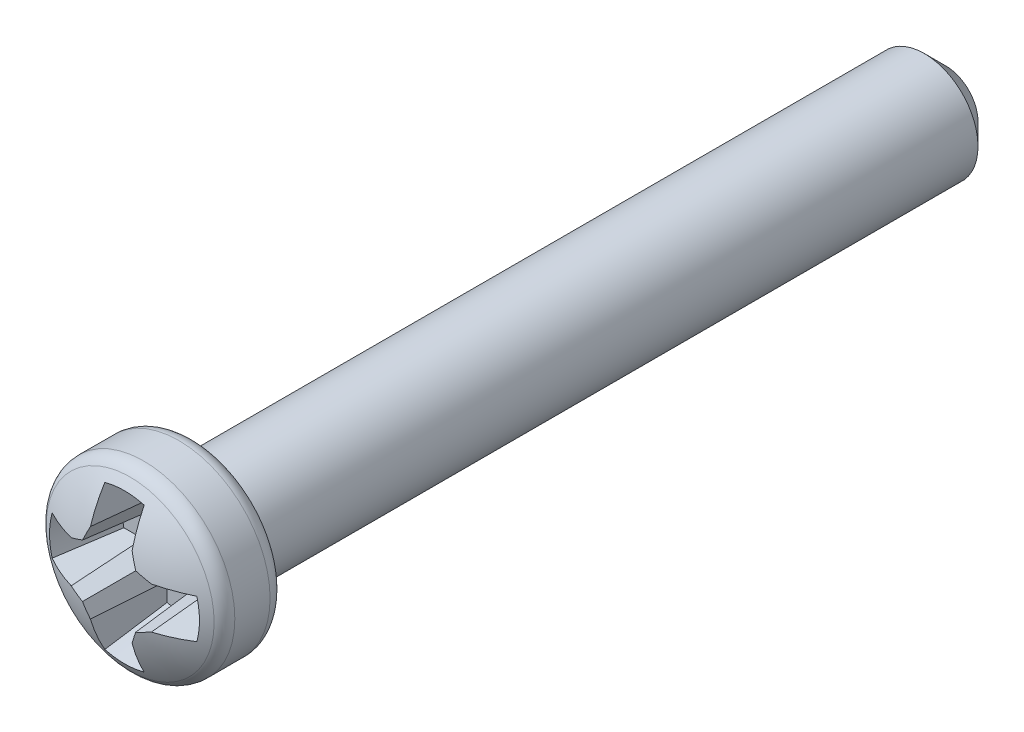
ISO-10303-21;
HEADER;
FILE_DESCRIPTION(('STEP AP214'),'2;1');
FILE_NAME('part.step','',(''),(''),'','','');
FILE_SCHEMA(('AUTOMOTIVE_DESIGN { 1 0 10303 214 1 1 1 1 }'));
ENDSEC;
DATA;
#1=APPLICATION_CONTEXT('core data for automotive mechanical design processes');
#2=APPLICATION_PROTOCOL_DEFINITION('international standard','automotive_design',2000,#1);
#3=PRODUCT_CONTEXT('',#1,'mechanical');
#4=PRODUCT('Part','Part','',(#3));
#5=PRODUCT_RELATED_PRODUCT_CATEGORY('part','',(#4));
#6=PRODUCT_DEFINITION_FORMATION('','',#4);
#7=PRODUCT_DEFINITION_CONTEXT('part definition',#1,'design');
#8=PRODUCT_DEFINITION('design','',#6,#7);
#9=PRODUCT_DEFINITION_SHAPE('','',#8);
#10=(LENGTH_UNIT() NAMED_UNIT(*) SI_UNIT(.MILLI.,.METRE.));
#11=(NAMED_UNIT(*) PLANE_ANGLE_UNIT() SI_UNIT($,.RADIAN.));
#12=(NAMED_UNIT(*) SI_UNIT($,.STERADIAN.) SOLID_ANGLE_UNIT());
#13=UNCERTAINTY_MEASURE_WITH_UNIT(LENGTH_MEASURE(1.E-05),#10,'distance_accuracy_value','');
#14=(GEOMETRIC_REPRESENTATION_CONTEXT(3) GLOBAL_UNCERTAINTY_ASSIGNED_CONTEXT((#13)) GLOBAL_UNIT_ASSIGNED_CONTEXT((#10,
#11,#12)) REPRESENTATION_CONTEXT('',''));
#15=CARTESIAN_POINT('',(0.,0.,0.));
#16=DIRECTION('',(0.,0.,1.));
#17=DIRECTION('',(1.,0.,0.));
#18=AXIS2_PLACEMENT_3D('',#15,#16,#17);
#19=CARTESIAN_POINT('',(-0.400000000000011,0.,15.7));
#20=DIRECTION('',(0.996194698091745,0.,0.0871557427476592));
#21=DIRECTION('',(0.,-1.,-1.20531199141214E-13));
#22=AXIS2_PLACEMENT_3D('',#19,#20,#21);
#23=PLANE('',#22);
#24=CARTESIAN_POINT('',(-0.155769339122426,0.,12.9084307722313));
#25=DIRECTION('',(0.996194698091745,0.,0.0871557427476592));
#26=DIRECTION('',(0.0871557427476592,0.,-0.996194698091745));
#27=AXIS2_PLACEMENT_3D('',#24,#25,#26);
#28=CIRCLE('',#27,2.77353697814506);
#29=CARTESIAN_POINT('',(-0.366942453606423,1.34976675197879,15.3221505157205));
#30=VERTEX_POINT('',#29);
#31=CARTESIAN_POINT('',(-0.388548913673451,0.747722237309709,15.5691134843641));
#32=VERTEX_POINT('',#31);
#33=EDGE_CURVE('E393',#30,#32,#28,.T.);
#34=ORIENTED_EDGE('',*,*,#33,.T.);
#35=DIRECTION('',(-0.0871426484044404,0.0173337504938601,0.996045029063886));
#36=VECTOR('',#35,1.);
#37=CARTESIAN_POINT('',(-0.400815427513501,0.750162198617128,15.7093203791284));
#38=LINE('',#37,#36);
#39=CARTESIAN_POINT('',(-0.273578881205041,0.724853275973701,14.255));
#40=VERTEX_POINT('',#39);
#41=EDGE_CURVE('E11',#40,#32,#38,.T.);
#42=ORIENTED_EDGE('',*,*,#41,.F.);
#43=DIRECTION('',(0.,-1.,0.));
#44=VECTOR('',#43,1.);
#45=CARTESIAN_POINT('',(-0.273578881205049,0.,14.255));
#46=LINE('',#45,#44);
#47=CARTESIAN_POINT('',(-0.273578881205038,1.07866041768189,14.255));
#48=VERTEX_POINT('',#47);
#49=EDGE_CURVE('E23',#48,#40,#46,.T.);
#50=ORIENTED_EDGE('',*,*,#49,.F.);
#51=CARTESIAN_POINT('',(-0.273578881205038,1.07866041768189,14.255));
#52=CARTESIAN_POINT('',(-0.304698622172029,1.16909490040446,14.6107002669011));
#53=CARTESIAN_POINT('',(-0.335820104838195,1.25945048805327,14.9664204415149));
#54=CARTESIAN_POINT('',(-0.366942453606423,1.34976675197879,15.3221505157205));
#55=(BOUNDED_CURVE() B_SPLINE_CURVE(3,(#51,#52,#53,#54),.UNSPECIFIED.,.F.,
.F.) B_SPLINE_CURVE_WITH_KNOTS((4,4),(0.0101147351762878,0.0112197354916044),
.UNSPECIFIED.) CURVE() GEOMETRIC_REPRESENTATION_ITEM() RATIONAL_B_SPLINE_CURVE((1.,1.,1.,1.)) REPRESENTATION_ITEM(''));
#56=EDGE_CURVE('E236',#48,#30,#55,.T.);
#57=ORIENTED_EDGE('',*,*,#56,.T.);
#58=EDGE_LOOP('',(#34,#42,#50,#57));
#59=FACE_BOUND('',#58,.T.);
#60=ADVANCED_FACE('F19',(#59),#23,.T.);
#61=CARTESIAN_POINT('',(-0.606586399182272,0.251256313292342,15.7));
#62=DIRECTION('',(0.920363891963223,-0.381227206369657,0.0871557427476588));
#63=DIRECTION('',(0.,-0.222868776578235,-0.974848454082234));
#64=AXIS2_PLACEMENT_3D('',#61,#62,#63);
#65=PLANE('',#64);
#66=CARTESIAN_POINT('',(-0.379146146396833,0.157047475959057,12.8861548030787));
#67=DIRECTION('',(0.920363891963223,-0.381227206369658,0.0871557427476588));
#68=DIRECTION('',(0.382683432365094,0.923879532511285,0.));
#69=AXIS2_PLACEMENT_3D('',#66,#67,#68);
#70=CIRCLE('',#69,2.74722630506);
#71=CARTESIAN_POINT('',(-0.496473166513852,0.496473166513839,15.6098062018733));
#72=VERTEX_POINT('',#71);
#73=EDGE_CURVE('E348',#32,#72,#70,.T.);
#74=ORIENTED_EDGE('',*,*,#73,.T.);
#75=DIRECTION('',(-0.0666626913468326,0.0666626913468326,0.995546167269401));
#76=VECTOR('',#75,1.);
#77=CARTESIAN_POINT('',(-0.5018585599701,0.501858559970086,15.6902321148732));
#78=LINE('',#77,#76);
#79=CARTESIAN_POINT('',(-0.405754091256932,0.405754091256919,14.255));
#80=VERTEX_POINT('',#79);
#81=EDGE_CURVE('E30',#80,#72,#78,.T.);
#82=ORIENTED_EDGE('',*,*,#81,.F.);
#83=DIRECTION('',(-0.382683432365094,-0.923879532511285,0.));
#84=VECTOR('',#83,1.);
#85=CARTESIAN_POINT('',(-0.489788515050423,0.202877045628466,14.255));
#86=LINE('',#85,#84);
#87=EDGE_CURVE('E242',#40,#80,#86,.T.);
#88=ORIENTED_EDGE('',*,*,#87,.F.);
#89=ORIENTED_EDGE('',*,*,#41,.T.);
#90=EDGE_LOOP('',(#74,#82,#88,#89));
#91=FACE_BOUND('',#90,.T.);
#92=ADVANCED_FACE('F596',(#91),#65,.T.);
#93=CARTESIAN_POINT('',(-0.251256313292353,0.606586399182252,15.7));
#94=DIRECTION('',(0.381227206369636,-0.920363891963232,0.0871557427476579));
#95=DIRECTION('',(0.,-0.0942752822069807,-0.995546167269401));
#96=AXIS2_PLACEMENT_3D('',#93,#94,#95);
#97=PLANE('',#96);
#98=CARTESIAN_POINT('',(-0.157047475959054,0.379146146396823,12.8861548030787));
#99=DIRECTION('',(0.381227206369636,-0.920363891963232,0.0871557427476579));
#100=DIRECTION('',(0.923879532511294,0.382683432365072,0.));
#101=AXIS2_PLACEMENT_3D('',#98,#99,#100);
#102=CIRCLE('',#101,2.74722630506);
#103=CARTESIAN_POINT('',(-0.747722237309725,0.388548913673444,15.5691134843641));
#104=VERTEX_POINT('',#103);
#105=EDGE_CURVE('E344',#72,#104,#102,.T.);
#106=ORIENTED_EDGE('',*,*,#105,.T.);
#107=DIRECTION('',(-0.0173337504938597,0.087142648404439,0.996045029063886));
#108=VECTOR('',#107,1.);
#109=CARTESIAN_POINT('',(-0.74977465582037,0.398867118306383,15.6870511029892));
#110=LINE('',#109,#108);
#111=CARTESIAN_POINT('',(-0.724853275973718,0.273578881205036,14.255));
#112=VERTEX_POINT('',#111);
#113=EDGE_CURVE('E405',#112,#104,#110,.T.);
#114=ORIENTED_EDGE('',*,*,#113,.F.);
#115=DIRECTION('',(-0.923879532511294,-0.382683432365072,0.));
#116=VECTOR('',#115,1.);
#117=CARTESIAN_POINT('',(-0.20287704562845,0.489788515050416,14.255));
#118=LINE('',#117,#116);
#119=EDGE_CURVE('E458',#80,#112,#118,.T.);
#120=ORIENTED_EDGE('',*,*,#119,.F.);
#121=ORIENTED_EDGE('',*,*,#81,.T.);
#122=EDGE_LOOP('',(#106,#114,#120,#121));
#123=FACE_BOUND('',#122,.T.);
#124=ADVANCED_FACE('F600',(#123),#97,.T.);
#125=CARTESIAN_POINT('',(0.,0.399999999999987,15.7));
#126=DIRECTION('',(0.,-0.996194698091746,0.0871557427476576));
#127=DIRECTION('',(-1.,0.,0.));
#128=AXIS2_PLACEMENT_3D('',#125,#126,#127);
#129=PLANE('',#128);
#130=CARTESIAN_POINT('',(0.,0.155769339122407,12.9084307722313));
#131=DIRECTION('',(0.,-0.996194698091746,0.0871557427476576));
#132=DIRECTION('',(0.,-0.0871557427476576,-0.996194698091746));
#133=AXIS2_PLACEMENT_3D('',#130,#131,#132);
#134=CIRCLE('',#133,2.77353697814506);
#135=CARTESIAN_POINT('',(-1.3497667519788,0.366942453606429,15.3221505157205));
#136=VERTEX_POINT('',#135);
#137=EDGE_CURVE('E349',#104,#136,#134,.T.);
#138=ORIENTED_EDGE('',*,*,#137,.T.);
#139=CARTESIAN_POINT('',(-1.07866041768188,0.273578881205039,14.255));
#140=CARTESIAN_POINT('',(-1.16909490040445,0.304698622172032,14.6107002669011));
#141=CARTESIAN_POINT('',(-1.25945048805327,0.335820104838199,14.9664204415149));
#142=CARTESIAN_POINT('',(-1.3497667519788,0.366942453606429,15.3221505157205));
#143=(BOUNDED_CURVE() B_SPLINE_CURVE(3,(#139,#140,#141,#142),.UNSPECIFIED.,.F.,
.F.) B_SPLINE_CURVE_WITH_KNOTS((4,4),(0.00303333154714993,0.00413833274330227),
.UNSPECIFIED.) CURVE() GEOMETRIC_REPRESENTATION_ITEM() RATIONAL_B_SPLINE_CURVE((1.,1.,1.,1.)) REPRESENTATION_ITEM(''));
#144=CARTESIAN_POINT('',(-1.07866041768188,0.273578881205039,14.255));
#145=VERTEX_POINT('',#144);
#146=EDGE_CURVE('E408',#145,#136,#143,.T.);
#147=ORIENTED_EDGE('',*,*,#146,.F.);
#148=DIRECTION('',(-1.,0.,0.));
#149=VECTOR('',#148,1.);
#150=CARTESIAN_POINT('',(0.,0.273578881205028,14.255));
#151=LINE('',#150,#149);
#152=EDGE_CURVE('E471',#112,#145,#151,.T.);
#153=ORIENTED_EDGE('',*,*,#152,.F.);
#154=ORIENTED_EDGE('',*,*,#113,.T.);
#155=EDGE_LOOP('',(#138,#147,#153,#154));
#156=FACE_BOUND('',#155,.T.);
#157=ADVANCED_FACE('F602',(#156),#129,.T.);
#158=CARTESIAN_POINT('',(0.,0.,15.7));
#159=DIRECTION('',(0.,0.,1.));
#160=DIRECTION('',(-1.,0.,0.));
#161=AXIS2_PLACEMENT_3D('',#158,#159,#160);
#162=CONICAL_SURFACE('',#161,1.5,0.26179938779915);
#163=CARTESIAN_POINT('',(0.,0.,15.3221505157205));
#164=DIRECTION('',(0.,0.,1.));
#165=DIRECTION('',(-1.,0.,0.));
#166=AXIS2_PLACEMENT_3D('',#163,#164,#165);
#167=CIRCLE('',#166,1.39875553582679);
#168=CARTESIAN_POINT('',(-1.3497667519788,-0.36694245360644,15.3221505157205));
#169=VERTEX_POINT('',#168);
#170=EDGE_CURVE('E379',#136,#169,#167,.T.);
#171=ORIENTED_EDGE('',*,*,#170,.T.);
#172=CARTESIAN_POINT('',(-1.07866041768189,-0.273578881205053,14.255));
#173=CARTESIAN_POINT('',(-1.16909490040446,-0.304698622172045,14.6107002669011));
#174=CARTESIAN_POINT('',(-1.25945048805328,-0.335820104838211,14.9664204415149));
#175=CARTESIAN_POINT('',(-1.3497667519788,-0.36694245360644,15.3221505157205));
#176=(BOUNDED_CURVE() B_SPLINE_CURVE(3,(#172,#173,#174,#175),.UNSPECIFIED.,.F.,
.F.) B_SPLINE_CURVE_WITH_KNOTS((4,4),(0.0101147351762878,0.0112197354916044),
.UNSPECIFIED.) CURVE() GEOMETRIC_REPRESENTATION_ITEM() RATIONAL_B_SPLINE_CURVE((1.,1.,1.,1.)) REPRESENTATION_ITEM(''));
#177=CARTESIAN_POINT('',(-1.07866041768189,-0.273578881205053,14.255));
#178=VERTEX_POINT('',#177);
#179=EDGE_CURVE('E368',#178,#169,#176,.T.);
#180=ORIENTED_EDGE('',*,*,#179,.F.);
#181=CARTESIAN_POINT('',(0.,0.,14.255));
#182=DIRECTION('',(0.,0.,1.));
#183=DIRECTION('',(1.,0.,0.));
#184=AXIS2_PLACEMENT_3D('',#181,#182,#183);
#185=CIRCLE('',#184,1.11281341693703);
#186=EDGE_CURVE('E415',#145,#178,#185,.T.);
#187=ORIENTED_EDGE('',*,*,#186,.F.);
#188=ORIENTED_EDGE('',*,*,#146,.T.);
#189=EDGE_LOOP('',(#171,#180,#187,#188));
#190=FACE_BOUND('',#189,.T.);
#191=ADVANCED_FACE('F606',(#190),#162,.F.);
#192=CARTESIAN_POINT('',(0.,-0.400000000000023,15.7));
#193=DIRECTION('',(0.,0.996194698091745,0.08715574274766));
#194=DIRECTION('',(1.,0.,0.));
#195=AXIS2_PLACEMENT_3D('',#192,#193,#194);
#196=PLANE('',#195);
#197=CARTESIAN_POINT('',(0.,-0.155769339122436,12.9084307722313));
#198=DIRECTION('',(0.,0.996194698091745,0.08715574274766));
#199=DIRECTION('',(0.,-0.08715574274766,0.996194698091745));
#200=AXIS2_PLACEMENT_3D('',#197,#198,#199);
#201=CIRCLE('',#200,2.77353697814506);
#202=CARTESIAN_POINT('',(-0.74772223730972,-0.388548913673466,15.5691134843641));
#203=VERTEX_POINT('',#202);
#204=EDGE_CURVE('E299',#169,#203,#201,.T.);
#205=ORIENTED_EDGE('',*,*,#204,.T.);
#206=DIRECTION('',(-0.0173337504938606,-0.0871426484044413,0.996045029063886));
#207=VECTOR('',#206,1.);
#208=CARTESIAN_POINT('',(-0.75016219861714,-0.400815427513517,15.7093203791284));
#209=LINE('',#208,#207);
#210=CARTESIAN_POINT('',(-0.724853275973712,-0.273578881205055,14.255));
#211=VERTEX_POINT('',#210);
#212=EDGE_CURVE('E365',#211,#203,#209,.T.);
#213=ORIENTED_EDGE('',*,*,#212,.F.);
#214=DIRECTION('',(1.,0.,0.));
#215=VECTOR('',#214,1.);
#216=CARTESIAN_POINT('',(0.,-0.27357888120506,14.255));
#217=LINE('',#216,#215);
#218=EDGE_CURVE('E333',#178,#211,#217,.T.);
#219=ORIENTED_EDGE('',*,*,#218,.F.);
#220=ORIENTED_EDGE('',*,*,#179,.T.);
#221=EDGE_LOOP('',(#205,#213,#219,#220));
#222=FACE_BOUND('',#221,.T.);
#223=ADVANCED_FACE('F610',(#222),#196,.T.);
#224=CARTESIAN_POINT('',(-0.251256313292352,-0.606586399182285,15.7));
#225=DIRECTION('',(0.381227206369654,0.920363891963224,0.0871557427476598));
#226=DIRECTION('',(0.22286877657824,0.,-0.974848454082233));
#227=AXIS2_PLACEMENT_3D('',#224,#225,#226);
#228=PLANE('',#227);
#229=CARTESIAN_POINT('',(-0.157047475959065,-0.379146146396845,12.8861548030787));
#230=DIRECTION('',(0.381227206369653,0.920363891963224,0.0871557427476598));
#231=DIRECTION('',(-0.923879532511287,0.38268343236509,0.));
#232=AXIS2_PLACEMENT_3D('',#229,#230,#231);
#233=CIRCLE('',#232,2.74722630506);
#234=CARTESIAN_POINT('',(-0.49647316651385,-0.496473166513867,15.6098062018733));
#235=VERTEX_POINT('',#234);
#236=EDGE_CURVE('E295',#203,#235,#233,.T.);
#237=ORIENTED_EDGE('',*,*,#236,.T.);
#238=DIRECTION('',(-0.0666626913468331,-0.0666626913468336,0.995546167269401));
#239=VECTOR('',#238,1.);
#240=CARTESIAN_POINT('',(-0.501858559970097,-0.501858559970114,15.6902321148732));
#241=LINE('',#240,#239);
#242=CARTESIAN_POINT('',(-0.405754091256929,-0.405754091256945,14.255));
#243=VERTEX_POINT('',#242);
#244=EDGE_CURVE('E361',#243,#235,#241,.T.);
#245=ORIENTED_EDGE('',*,*,#244,.F.);
#246=DIRECTION('',(0.923879532511287,-0.38268343236509,0.));
#247=VECTOR('',#246,1.);
#248=CARTESIAN_POINT('',(-0.20287704562847,-0.489788515050438,14.255));
#249=LINE('',#248,#247);
#250=EDGE_CURVE('E328',#211,#243,#249,.T.);
#251=ORIENTED_EDGE('',*,*,#250,.F.);
#252=ORIENTED_EDGE('',*,*,#212,.T.);
#253=EDGE_LOOP('',(#237,#245,#251,#252));
#254=FACE_BOUND('',#253,.T.);
#255=ADVANCED_FACE('F614',(#254),#228,.T.);
#256=CARTESIAN_POINT('',(-0.606586399182264,-0.251256313292368,15.7));
#257=DIRECTION('',(0.920363891963231,0.381227206369638,0.087155742747659));
#258=DIRECTION('',(0.,0.222868776578246,-0.974848454082231));
#259=AXIS2_PLACEMENT_3D('',#256,#257,#258);
#260=PLANE('',#259);
#261=CARTESIAN_POINT('',(-0.379146146396833,-0.157047475959064,12.8861548030787));
#262=DIRECTION('',(0.92036389196323,0.381227206369639,0.087155742747659));
#263=DIRECTION('',(-0.382683432365075,0.923879532511293,0.));
#264=AXIS2_PLACEMENT_3D('',#261,#262,#263);
#265=CIRCLE('',#264,2.74722630506);
#266=CARTESIAN_POINT('',(-0.388548913673453,-0.747722237309739,15.5691134843641));
#267=VERTEX_POINT('',#266);
#268=EDGE_CURVE('E300',#235,#267,#265,.T.);
#269=ORIENTED_EDGE('',*,*,#268,.T.);
#270=DIRECTION('',(-0.0871426484044398,-0.0173337504938608,0.996045029063886));
#271=VECTOR('',#270,1.);
#272=CARTESIAN_POINT('',(-0.398867118306393,-0.749774655820384,15.6870511029892));
#273=LINE('',#272,#271);
#274=CARTESIAN_POINT('',(-0.273578881205045,-0.724853275973731,14.255));
#275=VERTEX_POINT('',#274);
#276=EDGE_CURVE('E357',#275,#267,#273,.T.);
#277=ORIENTED_EDGE('',*,*,#276,.F.);
#278=DIRECTION('',(0.382683432365075,-0.923879532511293,0.));
#279=VECTOR('',#278,1.);
#280=CARTESIAN_POINT('',(-0.48978851505043,-0.202877045628457,14.255));
#281=LINE('',#280,#279);
#282=EDGE_CURVE('E332',#243,#275,#281,.T.);
#283=ORIENTED_EDGE('',*,*,#282,.F.);
#284=ORIENTED_EDGE('',*,*,#244,.T.);
#285=EDGE_LOOP('',(#269,#277,#283,#284));
#286=FACE_BOUND('',#285,.T.);
#287=ADVANCED_FACE('F617',(#286),#260,.T.);
#288=CARTESIAN_POINT('',(-0.4,0.,15.7));
#289=DIRECTION('',(0.996194698091746,0.,0.0871557427476584));
#290=DIRECTION('',(0.,-1.,0.));
#291=AXIS2_PLACEMENT_3D('',#288,#289,#290);
#292=PLANE('',#291);
#293=CARTESIAN_POINT('',(-0.155769339122418,0.,12.9084307722313));
#294=DIRECTION('',(0.996194698091746,0.,0.0871557427476584));
#295=DIRECTION('',(0.0871557427476584,0.,-0.996194698091746));
#296=AXIS2_PLACEMENT_3D('',#293,#294,#295);
#297=CIRCLE('',#296,2.77353697814506);
#298=CARTESIAN_POINT('',(-0.366942453606437,-1.34976675197881,15.3221505157205));
#299=VERTEX_POINT('',#298);
#300=EDGE_CURVE('E375',#267,#299,#297,.T.);
#301=ORIENTED_EDGE('',*,*,#300,.T.);
#302=CARTESIAN_POINT('',(-0.273578881205047,-1.07866041768189,14.255));
#303=CARTESIAN_POINT('',(-0.304698622172039,-1.16909490040447,14.6107002669011));
#304=CARTESIAN_POINT('',(-0.335820104838207,-1.25945048805328,14.9664204415149));
#305=CARTESIAN_POINT('',(-0.366942453606437,-1.34976675197881,15.3221505157205));
#306=(BOUNDED_CURVE() B_SPLINE_CURVE(3,(#302,#303,#304,#305),.UNSPECIFIED.,.F.,
.F.) B_SPLINE_CURVE_WITH_KNOTS((4,4),(0.00303333154714993,0.00413833274330227),
.UNSPECIFIED.) CURVE() GEOMETRIC_REPRESENTATION_ITEM() RATIONAL_B_SPLINE_CURVE((1.,1.,1.,1.)) REPRESENTATION_ITEM(''));
#307=CARTESIAN_POINT('',(-0.273578881205047,-1.07866041768189,14.255));
#308=VERTEX_POINT('',#307);
#309=EDGE_CURVE('E514',#308,#299,#306,.T.);
#310=ORIENTED_EDGE('',*,*,#309,.F.);
#311=DIRECTION('',(0.,-1.,0.));
#312=VECTOR('',#311,1.);
#313=CARTESIAN_POINT('',(-0.27357888120504,0.,14.255));
#314=LINE('',#313,#312);
#315=EDGE_CURVE('E445',#275,#308,#314,.T.);
#316=ORIENTED_EDGE('',*,*,#315,.F.);
#317=ORIENTED_EDGE('',*,*,#276,.T.);
#318=EDGE_LOOP('',(#301,#310,#316,#317));
#319=FACE_BOUND('',#318,.T.);
#320=ADVANCED_FACE('F549',(#319),#292,.T.);
#321=CARTESIAN_POINT('',(0.400000000000011,0.,15.7));
#322=DIRECTION('',(-0.996194698091745,0.,0.0871557427476592));
#323=DIRECTION('',(0.,1.,0.));
#324=AXIS2_PLACEMENT_3D('',#321,#322,#323);
#325=PLANE('',#324);
#326=CARTESIAN_POINT('',(0.155769339122426,0.,12.9084307722313));
#327=DIRECTION('',(-0.996194698091745,0.,0.0871557427476592));
#328=DIRECTION('',(0.0871557427476592,0.,0.996194698091745));
#329=AXIS2_PLACEMENT_3D('',#326,#327,#328);
#330=CIRCLE('',#329,2.77353697814506);
#331=CARTESIAN_POINT('',(0.366942453606433,-1.34976675197881,15.3221505157205));
#332=VERTEX_POINT('',#331);
#333=CARTESIAN_POINT('',(0.388548913673456,-0.747722237309731,15.5691134843641));
#334=VERTEX_POINT('',#333);
#335=EDGE_CURVE('E306',#332,#334,#330,.T.);
#336=ORIENTED_EDGE('',*,*,#335,.T.);
#337=DIRECTION('',(0.0871426484044404,-0.0173337504938611,0.996045029063886));
#338=VECTOR('',#337,1.);
#339=CARTESIAN_POINT('',(0.400815427513507,-0.750162198617151,15.7093203791284));
#340=LINE('',#339,#338);
#341=CARTESIAN_POINT('',(0.273578881205046,-0.724853275973723,14.255));
#342=VERTEX_POINT('',#341);
#343=EDGE_CURVE('E342',#342,#334,#340,.T.);
#344=ORIENTED_EDGE('',*,*,#343,.F.);
#345=DIRECTION('',(0.,1.,0.));
#346=VECTOR('',#345,1.);
#347=CARTESIAN_POINT('',(0.273578881205049,0.,14.255));
#348=LINE('',#347,#346);
#349=CARTESIAN_POINT('',(0.273578881205045,-1.0786604176819,14.255));
#350=VERTEX_POINT('',#349);
#351=EDGE_CURVE('E339',#350,#342,#348,.T.);
#352=ORIENTED_EDGE('',*,*,#351,.F.);
#353=CARTESIAN_POINT('',(0.273578881205045,-1.0786604176819,14.255));
#354=CARTESIAN_POINT('',(0.304698622172037,-1.16909490040448,14.6107002669011));
#355=CARTESIAN_POINT('',(0.335820104838204,-1.25945048805329,14.9664204415149));
#356=CARTESIAN_POINT('',(0.366942453606433,-1.34976675197881,15.3221505157205));
#357=(BOUNDED_CURVE() B_SPLINE_CURVE(3,(#353,#354,#355,#356),.UNSPECIFIED.,.F.,
.F.) B_SPLINE_CURVE_WITH_KNOTS((4,4),(0.0101147351762878,0.0112197354916044),
.UNSPECIFIED.) CURVE() GEOMETRIC_REPRESENTATION_ITEM() RATIONAL_B_SPLINE_CURVE((1.,1.,1.,1.)) REPRESENTATION_ITEM(''));
#358=EDGE_CURVE('E477',#350,#332,#357,.T.);
#359=ORIENTED_EDGE('',*,*,#358,.T.);
#360=EDGE_LOOP('',(#336,#344,#352,#359));
#361=FACE_BOUND('',#360,.T.);
#362=ADVANCED_FACE('F557',(#361),#325,.T.);
#363=CARTESIAN_POINT('',(0.606586399182273,-0.251256313292363,15.7));
#364=DIRECTION('',(-0.920363891963225,0.381227206369651,0.0871557427476594));
#365=DIRECTION('',(0.094275282206983,0.,0.995546167269401));
#366=AXIS2_PLACEMENT_3D('',#363,#364,#365);
#367=PLANE('',#366);
#368=CARTESIAN_POINT('',(0.379146146396836,-0.157047475959071,12.8861548030787));
#369=DIRECTION('',(-0.920363891963225,0.38122720636965,0.0871557427476594));
#370=DIRECTION('',(-0.382683432365087,-0.923879532511288,0.));
#371=AXIS2_PLACEMENT_3D('',#368,#369,#370);
#372=CIRCLE('',#371,2.74722630506);
#373=CARTESIAN_POINT('',(0.496473166513856,-0.496473166513861,15.6098062018733));
#374=VERTEX_POINT('',#373);
#375=EDGE_CURVE('E311',#334,#374,#372,.T.);
#376=ORIENTED_EDGE('',*,*,#375,.T.);
#377=DIRECTION('',(0.066662691346833,-0.0666626913468337,0.995546167269401));
#378=VECTOR('',#377,1.);
#379=CARTESIAN_POINT('',(0.501858559970103,-0.501858559970108,15.6902321148732));
#380=LINE('',#379,#378);
#381=CARTESIAN_POINT('',(0.405754091256935,-0.405754091256939,14.255));
#382=VERTEX_POINT('',#381);
#383=EDGE_CURVE('E43',#382,#374,#380,.T.);
#384=ORIENTED_EDGE('',*,*,#383,.F.);
#385=DIRECTION('',(0.382683432365087,0.923879532511288,0.));
#386=VECTOR('',#385,1.);
#387=CARTESIAN_POINT('',(0.489788515050433,-0.202877045628466,14.255));
#388=LINE('',#387,#386);
#389=EDGE_CURVE('E334',#342,#382,#388,.T.);
#390=ORIENTED_EDGE('',*,*,#389,.F.);
#391=ORIENTED_EDGE('',*,*,#343,.T.);
#392=EDGE_LOOP('',(#376,#384,#390,#391));
#393=FACE_BOUND('',#392,.T.);
#394=ADVANCED_FACE('F560',(#393),#367,.T.);
#395=CARTESIAN_POINT('',(0.251256313292357,-0.606586399182276,15.7));
#396=DIRECTION('',(-0.381227206369642,0.920363891963229,0.0871557427476594));
#397=DIRECTION('',(0.222868776578245,0.,0.974848454082231));
#398=AXIS2_PLACEMENT_3D('',#395,#396,#397);
#399=PLANE('',#398);
#400=CARTESIAN_POINT('',(0.157047475959058,-0.379146146396842,12.8861548030787));
#401=DIRECTION('',(-0.381227206369641,0.920363891963229,0.0871557427476594));
#402=DIRECTION('',(-0.923879532511292,-0.382683432365078,0.));
#403=AXIS2_PLACEMENT_3D('',#400,#401,#402);
#404=CIRCLE('',#403,2.74722630506);
#405=CARTESIAN_POINT('',(0.747722237309727,-0.388548913673463,15.5691134843641));
#406=VERTEX_POINT('',#405);
#407=EDGE_CURVE('E428',#374,#406,#404,.T.);
#408=ORIENTED_EDGE('',*,*,#407,.T.);
#409=DIRECTION('',(0.0173337504938603,-0.0871426484044405,0.996045029063886));
#410=VECTOR('',#409,1.);
#411=CARTESIAN_POINT('',(0.749774655820373,-0.398867118306403,15.6870511029892));
#412=LINE('',#411,#410);
#413=CARTESIAN_POINT('',(0.72485327597372,-0.273578881205054,14.255));
#414=VERTEX_POINT('',#413);
#415=EDGE_CURVE('E343',#414,#406,#412,.T.);
#416=ORIENTED_EDGE('',*,*,#415,.F.);
#417=DIRECTION('',(0.923879532511292,0.382683432365078,0.));
#418=VECTOR('',#417,1.);
#419=CARTESIAN_POINT('',(0.202877045628462,-0.489788515050434,14.255));
#420=LINE('',#419,#418);
#421=EDGE_CURVE('E338',#382,#414,#420,.T.);
#422=ORIENTED_EDGE('',*,*,#421,.F.);
#423=ORIENTED_EDGE('',*,*,#383,.T.);
#424=EDGE_LOOP('',(#408,#416,#422,#423));
#425=FACE_BOUND('',#424,.T.);
#426=ADVANCED_FACE('F568',(#425),#399,.T.);
#427=CARTESIAN_POINT('',(0.,-0.400000000000013,15.7));
#428=DIRECTION('',(0.,0.996194698091745,0.0871557427476592));
#429=DIRECTION('',(1.,0.,0.));
#430=AXIS2_PLACEMENT_3D('',#427,#428,#429);
#431=PLANE('',#430);
#432=CARTESIAN_POINT('',(0.,-0.155769339122428,12.9084307722313));
#433=DIRECTION('',(0.,0.996194698091745,0.0871557427476592));
#434=DIRECTION('',(0.,-0.0871557427476592,0.996194698091745));
#435=AXIS2_PLACEMENT_3D('',#432,#433,#434);
#436=CIRCLE('',#435,2.77353697814506);
#437=CARTESIAN_POINT('',(1.3497667519788,-0.366942453606444,15.3221505157205));
#438=VERTEX_POINT('',#437);
#439=EDGE_CURVE('E421',#406,#438,#436,.T.);
#440=ORIENTED_EDGE('',*,*,#439,.T.);
#441=CARTESIAN_POINT('',(1.07866041768188,-0.273578881205055,14.255));
#442=CARTESIAN_POINT('',(1.16909490040446,-0.304698622172047,14.6107002669011));
#443=CARTESIAN_POINT('',(1.25945048805327,-0.335820104838214,14.9664204415149));
#444=CARTESIAN_POINT('',(1.3497667519788,-0.366942453606444,15.3221505157205));
#445=(BOUNDED_CURVE() B_SPLINE_CURVE(3,(#441,#442,#443,#444),.UNSPECIFIED.,.F.,
.F.) B_SPLINE_CURVE_WITH_KNOTS((4,4),(0.00303333154714993,0.00413833274330227),
.UNSPECIFIED.) CURVE() GEOMETRIC_REPRESENTATION_ITEM() RATIONAL_B_SPLINE_CURVE((1.,1.,1.,1.)) REPRESENTATION_ITEM(''));
#446=CARTESIAN_POINT('',(1.07866041768188,-0.273578881205055,14.255));
#447=VERTEX_POINT('',#446);
#448=EDGE_CURVE('E265',#447,#438,#445,.T.);
#449=ORIENTED_EDGE('',*,*,#448,.F.);
#450=DIRECTION('',(1.,0.,0.));
#451=VECTOR('',#450,1.);
#452=CARTESIAN_POINT('',(0.,-0.273578881205051,14.255));
#453=LINE('',#452,#451);
#454=EDGE_CURVE('E243',#414,#447,#453,.T.);
#455=ORIENTED_EDGE('',*,*,#454,.F.);
#456=ORIENTED_EDGE('',*,*,#415,.T.);
#457=EDGE_LOOP('',(#440,#449,#455,#456));
#458=FACE_BOUND('',#457,.T.);
#459=ADVANCED_FACE('F570',(#458),#431,.T.);
#460=CARTESIAN_POINT('',(0.,0.,14.255));
#461=DIRECTION('',(0.,0.,1.));
#462=DIRECTION('',(1.,0.,0.));
#463=AXIS2_PLACEMENT_3D('',#460,#461,#462);
#464=PLANE('',#463);
#465=ORIENTED_EDGE('',*,*,#454,.T.);
#466=CARTESIAN_POINT('',(0.,0.,14.255));
#467=DIRECTION('',(0.,0.,1.));
#468=DIRECTION('',(1.,0.,0.));
#469=AXIS2_PLACEMENT_3D('',#466,#467,#468);
#470=CIRCLE('',#469,1.11281341693703);
#471=CARTESIAN_POINT('',(1.07866041768189,0.273578881205037,14.255));
#472=VERTEX_POINT('',#471);
#473=EDGE_CURVE('E420',#447,#472,#470,.T.);
#474=ORIENTED_EDGE('',*,*,#473,.T.);
#475=DIRECTION('',(-1.,0.,0.));
#476=VECTOR('',#475,1.);
#477=CARTESIAN_POINT('',(0.,0.273578881205037,14.255));
#478=LINE('',#477,#476);
#479=CARTESIAN_POINT('',(0.72485327597371,0.273578881205037,14.255));
#480=VERTEX_POINT('',#479);
#481=EDGE_CURVE('E326',#472,#480,#478,.T.);
#482=ORIENTED_EDGE('',*,*,#481,.T.);
#483=DIRECTION('',(-0.923879532511289,0.382683432365084,0.));
#484=VECTOR('',#483,1.);
#485=CARTESIAN_POINT('',(0.202877045628459,0.489788515050419,14.255));
#486=LINE('',#485,#484);
#487=CARTESIAN_POINT('',(0.405754091256926,0.405754091256924,14.255));
#488=VERTEX_POINT('',#487);
#489=EDGE_CURVE('E327',#480,#488,#486,.T.);
#490=ORIENTED_EDGE('',*,*,#489,.T.);
#491=DIRECTION('',(-0.382683432365081,0.92387953251129,0.));
#492=VECTOR('',#491,1.);
#493=CARTESIAN_POINT('',(0.48978851505042,0.202877045628457,14.255));
#494=LINE('',#493,#492);
#495=CARTESIAN_POINT('',(0.273578881205039,0.724853275973709,14.255));
#496=VERTEX_POINT('',#495);
#497=EDGE_CURVE('E356',#488,#496,#494,.T.);
#498=ORIENTED_EDGE('',*,*,#497,.T.);
#499=DIRECTION('',(0.,1.,0.));
#500=VECTOR('',#499,1.);
#501=CARTESIAN_POINT('',(0.27357888120504,0.,14.255));
#502=LINE('',#501,#500);
#503=CARTESIAN_POINT('',(0.273578881205039,1.07866041768189,14.255));
#504=VERTEX_POINT('',#503);
#505=EDGE_CURVE('E248',#496,#504,#502,.T.);
#506=ORIENTED_EDGE('',*,*,#505,.T.);
#507=CARTESIAN_POINT('',(0.,0.,14.255));
#508=DIRECTION('',(0.,0.,1.));
#509=DIRECTION('',(1.,0.,0.));
#510=AXIS2_PLACEMENT_3D('',#507,#508,#509);
#511=CIRCLE('',#510,1.11281341693703);
#512=EDGE_CURVE('E245',#504,#48,#511,.T.);
#513=ORIENTED_EDGE('',*,*,#512,.T.);
#514=ORIENTED_EDGE('',*,*,#49,.T.);
#515=ORIENTED_EDGE('',*,*,#87,.T.);
#516=ORIENTED_EDGE('',*,*,#119,.T.);
#517=ORIENTED_EDGE('',*,*,#152,.T.);
#518=ORIENTED_EDGE('',*,*,#186,.T.);
#519=ORIENTED_EDGE('',*,*,#218,.T.);
#520=ORIENTED_EDGE('',*,*,#250,.T.);
#521=ORIENTED_EDGE('',*,*,#282,.T.);
#522=ORIENTED_EDGE('',*,*,#315,.T.);
#523=CARTESIAN_POINT('',(0.,0.,14.255));
#524=DIRECTION('',(0.,0.,1.));
#525=DIRECTION('',(1.,0.,0.));
#526=AXIS2_PLACEMENT_3D('',#523,#524,#525);
#527=CIRCLE('',#526,1.11281341693703);
#528=EDGE_CURVE('E496',#308,#350,#527,.T.);
#529=ORIENTED_EDGE('',*,*,#528,.T.);
#530=ORIENTED_EDGE('',*,*,#351,.T.);
#531=ORIENTED_EDGE('',*,*,#389,.T.);
#532=ORIENTED_EDGE('',*,*,#421,.T.);
#533=EDGE_LOOP('',(#465,#474,#482,#490,#498,#506,#513,#514,#515,#516,#517,#518,#519,#520,#521,
#522,#529,#530,#531,#532));
#534=FACE_BOUND('',#533,.T.);
#535=ADVANCED_FACE('F246',(#534),#464,.T.);
#536=CARTESIAN_POINT('',(0.,0.4,15.7));
#537=DIRECTION('',(0.,-0.996194698091746,0.0871557427476584));
#538=DIRECTION('',(-1.,0.,0.));
#539=AXIS2_PLACEMENT_3D('',#536,#537,#538);
#540=PLANE('',#539);
#541=CARTESIAN_POINT('',(0.,0.155769339122415,12.9084307722313));
#542=DIRECTION('',(0.,-0.996194698091746,0.0871557427476584));
#543=DIRECTION('',(0.,-0.0871557427476584,-0.996194698091746));
#544=AXIS2_PLACEMENT_3D('',#541,#542,#543);
#545=CIRCLE('',#544,2.77353697814506);
#546=CARTESIAN_POINT('',(1.3497667519788,0.366942453606425,15.3221505157205));
#547=VERTEX_POINT('',#546);
#548=CARTESIAN_POINT('',(0.747722237309717,0.388548913673446,15.5691134843641));
#549=VERTEX_POINT('',#548);
#550=EDGE_CURVE('E293',#547,#549,#545,.T.);
#551=ORIENTED_EDGE('',*,*,#550,.T.);
#552=DIRECTION('',(0.0173337504938599,0.0871426484044397,0.996045029063886));
#553=VECTOR('',#552,1.);
#554=CARTESIAN_POINT('',(0.750162198617137,0.400815427513497,15.7093203791284));
#555=LINE('',#554,#553);
#556=EDGE_CURVE('E323',#480,#549,#555,.T.);
#557=ORIENTED_EDGE('',*,*,#556,.F.);
#558=ORIENTED_EDGE('',*,*,#481,.F.);
#559=CARTESIAN_POINT('',(1.07866041768189,0.273578881205037,14.255));
#560=CARTESIAN_POINT('',(1.16909490040446,0.304698622172029,14.6107002669011));
#561=CARTESIAN_POINT('',(1.25945048805327,0.335820104838196,14.9664204415149));
#562=CARTESIAN_POINT('',(1.3497667519788,0.366942453606425,15.3221505157205));
#563=(BOUNDED_CURVE() B_SPLINE_CURVE(3,(#559,#560,#561,#562),.UNSPECIFIED.,.F.,
.F.) B_SPLINE_CURVE_WITH_KNOTS((4,4),(0.0101147351762878,0.0112197354916044),
.UNSPECIFIED.) CURVE() GEOMETRIC_REPRESENTATION_ITEM() RATIONAL_B_SPLINE_CURVE((1.,1.,1.,1.)) REPRESENTATION_ITEM(''));
#564=EDGE_CURVE('E259',#472,#547,#563,.T.);
#565=ORIENTED_EDGE('',*,*,#564,.T.);
#566=EDGE_LOOP('',(#551,#557,#558,#565));
#567=FACE_BOUND('',#566,.T.);
#568=ADVANCED_FACE('F578',(#567),#540,.T.);
#569=CARTESIAN_POINT('',(0.251256313292348,0.606586399182262,15.7));
#570=DIRECTION('',(-0.381227206369648,-0.920363891963227,0.0871557427476584));
#571=DIRECTION('',(-0.923879532511289,0.382683432365084,0.));
#572=AXIS2_PLACEMENT_3D('',#569,#570,#571);
#573=PLANE('',#572);
#574=CARTESIAN_POINT('',(0.157047475959061,0.379146146396826,12.8861548030787));
#575=DIRECTION('',(-0.381227206369648,-0.920363891963227,0.0871557427476584));
#576=DIRECTION('',(0.923879532511289,-0.382683432365084,0.));
#577=AXIS2_PLACEMENT_3D('',#574,#575,#576);
#578=CIRCLE('',#577,2.74722630506);
#579=CARTESIAN_POINT('',(0.496473166513847,0.496473166513845,15.6098062018733));
#580=VERTEX_POINT('',#579);
#581=EDGE_CURVE('E289',#549,#580,#578,.T.);
#582=ORIENTED_EDGE('',*,*,#581,.T.);
#583=DIRECTION('',(0.0666626913468327,0.0666626913468325,0.995546167269401));
#584=VECTOR('',#583,1.);
#585=CARTESIAN_POINT('',(0.501858559970094,0.501858559970092,15.6902321148732));
#586=LINE('',#585,#584);
#587=EDGE_CURVE('E353',#488,#580,#586,.T.);
#588=ORIENTED_EDGE('',*,*,#587,.F.);
#589=ORIENTED_EDGE('',*,*,#489,.F.);
#590=ORIENTED_EDGE('',*,*,#556,.T.);
#591=EDGE_LOOP('',(#582,#588,#589,#590));
#592=FACE_BOUND('',#591,.T.);
#593=ADVANCED_FACE('F583',(#592),#573,.T.);
#594=CARTESIAN_POINT('',(0.606586399182262,0.251256313292347,15.7));
#595=DIRECTION('',(-0.920363891963228,-0.381227206369645,0.0871557427476583));
#596=DIRECTION('',(-0.382683432365081,0.92387953251129,0.));
#597=AXIS2_PLACEMENT_3D('',#594,#595,#596);
#598=PLANE('',#597);
#599=CARTESIAN_POINT('',(0.37914614639683,0.15704747595905,12.8861548030787));
#600=DIRECTION('',(-0.920363891963228,-0.381227206369645,0.0871557427476583));
#601=DIRECTION('',(0.382683432365081,-0.92387953251129,0.));
#602=AXIS2_PLACEMENT_3D('',#599,#600,#601);
#603=CIRCLE('',#602,2.74722630506);
#604=CARTESIAN_POINT('',(0.388548913673448,0.747722237309716,15.5691134843641));
#605=VERTEX_POINT('',#604);
#606=EDGE_CURVE('E294',#580,#605,#603,.T.);
#607=ORIENTED_EDGE('',*,*,#606,.T.);
#608=DIRECTION('',(0.0871426484044397,0.0173337504938598,0.996045029063886));
#609=VECTOR('',#608,1.);
#610=CARTESIAN_POINT('',(0.398867118306387,0.749774655820362,15.6870511029892));
#611=LINE('',#610,#609);
#612=EDGE_CURVE('E364',#496,#605,#611,.T.);
#613=ORIENTED_EDGE('',*,*,#612,.F.);
#614=ORIENTED_EDGE('',*,*,#497,.F.);
#615=ORIENTED_EDGE('',*,*,#587,.T.);
#616=EDGE_LOOP('',(#607,#613,#614,#615));
#617=FACE_BOUND('',#616,.T.);
#618=ADVANCED_FACE('F587',(#617),#598,.T.);
#619=CARTESIAN_POINT('',(0.4,0.,15.7));
#620=DIRECTION('',(-0.996194698091746,0.,0.0871557427476584));
#621=DIRECTION('',(0.,1.,0.));
#622=AXIS2_PLACEMENT_3D('',#619,#620,#621);
#623=PLANE('',#622);
#624=CARTESIAN_POINT('',(0.155769339122418,0.,12.9084307722313));
#625=DIRECTION('',(-0.996194698091746,0.,0.0871557427476584));
#626=DIRECTION('',(0.0871557427476584,0.,0.996194698091746));
#627=AXIS2_PLACEMENT_3D('',#624,#625,#626);
#628=CIRCLE('',#627,2.77353697814506);
#629=CARTESIAN_POINT('',(0.366942453606427,1.34976675197879,15.3221505157205));
#630=VERTEX_POINT('',#629);
#631=EDGE_CURVE('E371',#605,#630,#628,.T.);
#632=ORIENTED_EDGE('',*,*,#631,.T.);
#633=CARTESIAN_POINT('',(0.273578881205039,1.07866041768189,14.255));
#634=CARTESIAN_POINT('',(0.304698622172031,1.16909490040446,14.6107002669011));
#635=CARTESIAN_POINT('',(0.335820104838198,1.25945048805327,14.9664204415149));
#636=CARTESIAN_POINT('',(0.366942453606427,1.34976675197879,15.3221505157205));
#637=(BOUNDED_CURVE() B_SPLINE_CURVE(3,(#633,#634,#635,#636),.UNSPECIFIED.,.F.,
.F.) B_SPLINE_CURVE_WITH_KNOTS((4,4),(0.00303333154714993,0.00413833274330227),
.UNSPECIFIED.) CURVE() GEOMETRIC_REPRESENTATION_ITEM() RATIONAL_B_SPLINE_CURVE((1.,1.,1.,1.)) REPRESENTATION_ITEM(''));
#638=EDGE_CURVE('E252',#504,#630,#637,.T.);
#639=ORIENTED_EDGE('',*,*,#638,.F.);
#640=ORIENTED_EDGE('',*,*,#505,.F.);
#641=ORIENTED_EDGE('',*,*,#612,.T.);
#642=EDGE_LOOP('',(#632,#639,#640,#641));
#643=FACE_BOUND('',#642,.T.);
#644=ADVANCED_FACE('F591',(#643),#623,.T.);
#645=CARTESIAN_POINT('',(0.,0.,15.7));
#646=DIRECTION('',(0.,0.,1.));
#647=DIRECTION('',(1.,0.,0.));
#648=AXIS2_PLACEMENT_3D('',#645,#646,#647);
#649=CONICAL_SURFACE('',#648,1.5,0.26179938779915);
#650=CARTESIAN_POINT('',(0.,0.,15.3221505157205));
#651=DIRECTION('',(0.,0.,1.));
#652=DIRECTION('',(-1.,0.,0.));
#653=AXIS2_PLACEMENT_3D('',#650,#651,#652);
#654=CIRCLE('',#653,1.39875553582679);
#655=EDGE_CURVE('E257',#630,#30,#654,.T.);
#656=ORIENTED_EDGE('',*,*,#655,.T.);
#657=ORIENTED_EDGE('',*,*,#56,.F.);
#658=ORIENTED_EDGE('',*,*,#512,.F.);
#659=ORIENTED_EDGE('',*,*,#638,.T.);
#660=EDGE_LOOP('',(#656,#657,#658,#659));
#661=FACE_BOUND('',#660,.T.);
#662=ADVANCED_FACE('F255',(#661),#649,.F.);
#663=CARTESIAN_POINT('',(0.,0.,15.7));
#664=DIRECTION('',(0.,0.,1.));
#665=DIRECTION('',(1.,0.,0.));
#666=AXIS2_PLACEMENT_3D('',#663,#664,#665);
#667=CONICAL_SURFACE('',#666,1.5,0.26179938779915);
#668=ORIENTED_EDGE('',*,*,#473,.F.);
#669=ORIENTED_EDGE('',*,*,#448,.T.);
#670=CARTESIAN_POINT('',(0.,0.,15.3221505157205));
#671=DIRECTION('',(0.,0.,1.));
#672=DIRECTION('',(-1.,0.,0.));
#673=AXIS2_PLACEMENT_3D('',#670,#671,#672);
#674=CIRCLE('',#673,1.39875553582679);
#675=EDGE_CURVE('E429',#438,#547,#674,.T.);
#676=ORIENTED_EDGE('',*,*,#675,.T.);
#677=ORIENTED_EDGE('',*,*,#564,.F.);
#678=EDGE_LOOP('',(#668,#669,#676,#677));
#679=FACE_BOUND('',#678,.T.);
#680=ADVANCED_FACE('F21',(#679),#667,.F.);
#681=CARTESIAN_POINT('',(0.,0.,15.7));
#682=DIRECTION('',(0.,0.,1.));
#683=DIRECTION('',(0.,-1.,0.));
#684=AXIS2_PLACEMENT_3D('',#681,#682,#683);
#685=CONICAL_SURFACE('',#684,1.5,0.26179938779915);
#686=ORIENTED_EDGE('',*,*,#528,.F.);
#687=ORIENTED_EDGE('',*,*,#309,.T.);
#688=CARTESIAN_POINT('',(0.,0.,15.3221505157205));
#689=DIRECTION('',(0.,0.,1.));
#690=DIRECTION('',(0.,1.,0.));
#691=AXIS2_PLACEMENT_3D('',#688,#689,#690);
#692=CIRCLE('',#691,1.39875553582679);
#693=EDGE_CURVE('E310',#299,#332,#692,.T.);
#694=ORIENTED_EDGE('',*,*,#693,.T.);
#695=ORIENTED_EDGE('',*,*,#358,.F.);
#696=EDGE_LOOP('',(#686,#687,#694,#695));
#697=FACE_BOUND('',#696,.T.);
#698=ADVANCED_FACE('F554',(#697),#685,.F.);
#699=CARTESIAN_POINT('',(0.,0.,14.));
#700=DIRECTION('',(0.,0.,-1.));
#701=DIRECTION('',(0.,-1.,0.));
#702=AXIS2_PLACEMENT_3D('',#699,#700,#701);
#703=PLANE('',#702);
#704=CARTESIAN_POINT('',(0.,0.,14.));
#705=DIRECTION('',(0.,0.,1.));
#706=DIRECTION('',(1.,0.,0.));
#707=AXIS2_PLACEMENT_3D('',#704,#705,#706);
#708=CIRCLE('',#707,1.);
#709=CARTESIAN_POINT('',(-1.,0.,14.));
#710=VERTEX_POINT('',#709);
#711=EDGE_CURVE('E382',#710,#710,#708,.T.);
#712=ORIENTED_EDGE('',*,*,#711,.T.);
#713=EDGE_LOOP('',(#712));
#714=FACE_BOUND('',#713,.T.);
#715=CARTESIAN_POINT('',(0.,0.,14.));
#716=DIRECTION('',(0.,0.,1.));
#717=DIRECTION('',(-1.,0.,0.));
#718=AXIS2_PLACEMENT_3D('',#715,#716,#717);
#719=CIRCLE('',#718,1.394);
#720=CARTESIAN_POINT('',(-1.394,0.,14.));
#721=VERTEX_POINT('',#720);
#722=EDGE_CURVE('E392',#721,#721,#719,.T.);
#723=ORIENTED_EDGE('',*,*,#722,.F.);
#724=EDGE_LOOP('',(#723));
#725=FACE_BOUND('',#724,.T.);
#726=ADVANCED_FACE('F695',(#714,#725),#703,.T.);
#727=CARTESIAN_POINT('',(0.,0.,14.306));
#728=DIRECTION('',(0.,0.,1.));
#729=DIRECTION('',(1.,0.,0.));
#730=AXIS2_PLACEMENT_3D('',#727,#728,#729);
#731=TOROIDAL_SURFACE('',#730,1.394,0.306);
#732=CARTESIAN_POINT('',(0.,0.,14.306));
#733=DIRECTION('',(0.,0.,-1.));
#734=DIRECTION('',(-1.,0.,0.));
#735=AXIS2_PLACEMENT_3D('',#732,#733,#734);
#736=CIRCLE('',#735,1.7);
#737=CARTESIAN_POINT('',(1.7,0.,14.306));
#738=VERTEX_POINT('',#737);
#739=CARTESIAN_POINT('',(-1.7,0.,14.306));
#740=VERTEX_POINT('',#739);
#741=EDGE_CURVE('E305',#738,#740,#736,.T.);
#742=ORIENTED_EDGE('',*,*,#741,.T.);
#743=CARTESIAN_POINT('',(-1.394,0.,14.306));
#744=DIRECTION('',(0.,-1.,0.));
#745=DIRECTION('',(-1.,0.,0.));
#746=AXIS2_PLACEMENT_3D('',#743,#744,#745);
#747=CIRCLE('',#746,0.306);
#748=EDGE_CURVE('E388',#740,#721,#747,.T.);
#749=ORIENTED_EDGE('',*,*,#748,.T.);
#750=ORIENTED_EDGE('',*,*,#722,.T.);
#751=ORIENTED_EDGE('',*,*,#748,.F.);
#752=CARTESIAN_POINT('',(0.,0.,14.306));
#753=DIRECTION('',(0.,0.,-1.));
#754=DIRECTION('',(-1.,0.,0.));
#755=AXIS2_PLACEMENT_3D('',#752,#753,#754);
#756=CIRCLE('',#755,1.7);
#757=EDGE_CURVE('E304',#740,#738,#756,.T.);
#758=ORIENTED_EDGE('',*,*,#757,.T.);
#759=EDGE_LOOP('',(#742,#749,#750,#751,#758));
#760=FACE_BOUND('',#759,.T.);
#761=ADVANCED_FACE('F698',(#760),#731,.T.);
#762=CARTESIAN_POINT('',(0.,0.,12.9220588235294));
#763=DIRECTION('',(-1.,0.,0.));
#764=DIRECTION('',(0.,1.,0.));
#765=AXIS2_PLACEMENT_3D('',#762,#763,#764);
#766=SPHERICAL_SURFACE('',#765,2.7779411764706);
#767=ORIENTED_EDGE('',*,*,#655,.F.);
#768=ORIENTED_EDGE('',*,*,#631,.F.);
#769=ORIENTED_EDGE('',*,*,#606,.F.);
#770=ORIENTED_EDGE('',*,*,#581,.F.);
#771=ORIENTED_EDGE('',*,*,#550,.F.);
#772=ORIENTED_EDGE('',*,*,#675,.F.);
#773=ORIENTED_EDGE('',*,*,#439,.F.);
#774=ORIENTED_EDGE('',*,*,#407,.F.);
#775=ORIENTED_EDGE('',*,*,#375,.F.);
#776=ORIENTED_EDGE('',*,*,#335,.F.);
#777=ORIENTED_EDGE('',*,*,#693,.F.);
#778=ORIENTED_EDGE('',*,*,#300,.F.);
#779=ORIENTED_EDGE('',*,*,#268,.F.);
#780=ORIENTED_EDGE('',*,*,#236,.F.);
#781=ORIENTED_EDGE('',*,*,#204,.F.);
#782=ORIENTED_EDGE('',*,*,#170,.F.);
#783=ORIENTED_EDGE('',*,*,#137,.F.);
#784=ORIENTED_EDGE('',*,*,#105,.F.);
#785=ORIENTED_EDGE('',*,*,#73,.F.);
#786=ORIENTED_EDGE('',*,*,#33,.F.);
#787=EDGE_LOOP('',(#767,#768,#769,#770,#771,#772,#773,#774,#775,#776,#777,#778,#779,#780,#781,
#782,#783,#784,#785,#786));
#788=FACE_BOUND('',#787,.T.);
#789=CARTESIAN_POINT('',(0.,0.,15.2161467809123));
#790=DIRECTION('',(0.,0.,-1.));
#791=DIRECTION('',(-1.,0.,0.));
#792=AXIS2_PLACEMENT_3D('',#789,#790,#791);
#793=CIRCLE('',#792,1.56656235870833);
#794=CARTESIAN_POINT('',(1.56656235870833,0.,15.2161467809123));
#795=VERTEX_POINT('',#794);
#796=EDGE_CURVE('E322',#795,#795,#793,.T.);
#797=ORIENTED_EDGE('',*,*,#796,.F.);
#798=EDGE_LOOP('',(#797));
#799=FACE_BOUND('',#798,.T.);
#800=ADVANCED_FACE('F564',(#788,#799),#766,.T.);
#801=CARTESIAN_POINT('',(0.,0.,0.));
#802=DIRECTION('',(0.,0.,-1.));
#803=DIRECTION('',(-1.,0.,0.));
#804=AXIS2_PLACEMENT_3D('',#801,#802,#803);
#805=CYLINDRICAL_SURFACE('',#804,1.7);
#806=ORIENTED_EDGE('',*,*,#741,.F.);
#807=DIRECTION('',(0.,0.,1.));
#808=VECTOR('',#807,1.);
#809=CARTESIAN_POINT('',(1.7,0.,0.));
#810=LINE('',#809,#808);
#811=CARTESIAN_POINT('',(1.7,0.,14.9634449163425));
#812=VERTEX_POINT('',#811);
#813=EDGE_CURVE('E301',#738,#812,#810,.T.);
#814=ORIENTED_EDGE('',*,*,#813,.T.);
#815=CARTESIAN_POINT('',(0.,0.,14.9634449163425));
#816=DIRECTION('',(0.,0.,1.));
#817=DIRECTION('',(-1.,0.,0.));
#818=AXIS2_PLACEMENT_3D('',#815,#816,#817);
#819=CIRCLE('',#818,1.7);
#820=EDGE_CURVE('E283',#812,#812,#819,.T.);
#821=ORIENTED_EDGE('',*,*,#820,.F.);
#822=ORIENTED_EDGE('',*,*,#813,.F.);
#823=ORIENTED_EDGE('',*,*,#757,.F.);
#824=EDGE_LOOP('',(#806,#814,#821,#822,#823));
#825=FACE_BOUND('',#824,.T.);
#826=ADVANCED_FACE('F703',(#825),#805,.T.);
#827=CARTESIAN_POINT('',(0.,0.,14.9634449163425));
#828=DIRECTION('',(0.,0.,-1.));
#829=DIRECTION('',(-1.,0.,0.));
#830=AXIS2_PLACEMENT_3D('',#827,#828,#829);
#831=TOROIDAL_SURFACE('',#830,1.394,0.306);
#832=ORIENTED_EDGE('',*,*,#820,.T.);
#833=CARTESIAN_POINT('',(1.394,0.,14.9634449163425));
#834=DIRECTION('',(0.,-1.,0.));
#835=DIRECTION('',(1.,0.,0.));
#836=AXIS2_PLACEMENT_3D('',#833,#834,#835);
#837=CIRCLE('',#836,0.306);
#838=EDGE_CURVE('E287',#812,#795,#837,.T.);
#839=ORIENTED_EDGE('',*,*,#838,.T.);
#840=ORIENTED_EDGE('',*,*,#796,.T.);
#841=ORIENTED_EDGE('',*,*,#838,.F.);
#842=EDGE_LOOP('',(#832,#839,#840,#841));
#843=FACE_BOUND('',#842,.T.);
#844=ADVANCED_FACE('F789',(#843),#831,.T.);
#845=CARTESIAN_POINT('',(0.,0.,0.));
#846=DIRECTION('',(0.,0.,1.));
#847=DIRECTION('',(1.,0.,0.));
#848=AXIS2_PLACEMENT_3D('',#845,#846,#847);
#849=PLANE('',#848);
#850=CARTESIAN_POINT('',(0.,0.,0.));
#851=DIRECTION('',(0.,0.,1.));
#852=DIRECTION('',(-1.,0.,0.));
#853=AXIS2_PLACEMENT_3D('',#850,#851,#852);
#854=CIRCLE('',#853,0.6);
#855=CARTESIAN_POINT('',(0.6,0.,0.));
#856=VERTEX_POINT('',#855);
#857=EDGE_CURVE('E275',#856,#856,#854,.T.);
#858=ORIENTED_EDGE('',*,*,#857,.F.);
#859=EDGE_LOOP('',(#858));
#860=FACE_BOUND('',#859,.T.);
#861=ADVANCED_FACE('F693',(#860),#849,.F.);
#862=CARTESIAN_POINT('',(0.,0.,0.));
#863=DIRECTION('',(0.,0.,1.));
#864=DIRECTION('',(1.,0.,0.));
#865=AXIS2_PLACEMENT_3D('',#862,#863,#864);
#866=CYLINDRICAL_SURFACE('',#865,1.);
#867=ORIENTED_EDGE('',*,*,#711,.F.);
#868=DIRECTION('',(0.,0.,-1.));
#869=VECTOR('',#868,1.);
#870=CARTESIAN_POINT('',(-1.,0.,0.));
#871=LINE('',#870,#869);
#872=CARTESIAN_POINT('',(-1.,0.,0.4));
#873=VERTEX_POINT('',#872);
#874=EDGE_CURVE('E288',#710,#873,#871,.T.);
#875=ORIENTED_EDGE('',*,*,#874,.T.);
#876=CARTESIAN_POINT('',(0.,0.,0.4));
#877=DIRECTION('',(0.,0.,-1.));
#878=DIRECTION('',(-1.,0.,0.));
#879=AXIS2_PLACEMENT_3D('',#876,#877,#878);
#880=CIRCLE('',#879,1.);
#881=CARTESIAN_POINT('',(1.,0.,0.4));
#882=VERTEX_POINT('',#881);
#883=EDGE_CURVE('E400',#882,#873,#880,.T.);
#884=ORIENTED_EDGE('',*,*,#883,.F.);
#885=CARTESIAN_POINT('',(0.,0.,0.4));
#886=DIRECTION('',(0.,0.,-1.));
#887=DIRECTION('',(-1.,0.,0.));
#888=AXIS2_PLACEMENT_3D('',#885,#886,#887);
#889=CIRCLE('',#888,1.);
#890=EDGE_CURVE('E404',#873,#882,#889,.T.);
#891=ORIENTED_EDGE('',*,*,#890,.F.);
#892=ORIENTED_EDGE('',*,*,#874,.F.);
#893=EDGE_LOOP('',(#867,#875,#884,#891,#892));
#894=FACE_BOUND('',#893,.T.);
#895=ADVANCED_FACE('F689',(#894),#866,.T.);
#896=CARTESIAN_POINT('',(0.,0.,0.2));
#897=DIRECTION('',(0.,0.,1.));
#898=DIRECTION('',(-1.,0.,0.));
#899=AXIS2_PLACEMENT_3D('',#896,#897,#898);
#900=CONICAL_SURFACE('',#899,0.8,0.785398163397448);
#901=ORIENTED_EDGE('',*,*,#857,.T.);
#902=DIRECTION('',(0.707106781186547,0.,0.707106781186548));
#903=VECTOR('',#902,1.);
#904=CARTESIAN_POINT('',(0.8,0.,0.2));
#905=LINE('',#904,#903);
#906=EDGE_CURVE('E282',#856,#882,#905,.T.);
#907=ORIENTED_EDGE('',*,*,#906,.T.);
#908=ORIENTED_EDGE('',*,*,#883,.T.);
#909=ORIENTED_EDGE('',*,*,#890,.T.);
#910=ORIENTED_EDGE('',*,*,#906,.F.);
#911=EDGE_LOOP('',(#901,#907,#908,#909,#910));
#912=FACE_BOUND('',#911,.T.);
#913=ADVANCED_FACE('F692',(#912),#900,.T.);
#914=CLOSED_SHELL('',(#60,#92,#124,#157,#191,#223,#255,#287,#320,#362,#394,#426,#459,#535,#568,
#593,#618,#644,#662,#680,#698,#726,#761,#800,#826,#844,#861,#895,#913));
#915=MANIFOLD_SOLID_BREP('B1',#914);
#916=ADVANCED_BREP_SHAPE_REPRESENTATION('',(#18,#915),#14);
#917=SHAPE_DEFINITION_REPRESENTATION(#9,#916);
ENDSEC;
END-ISO-10303-21;
